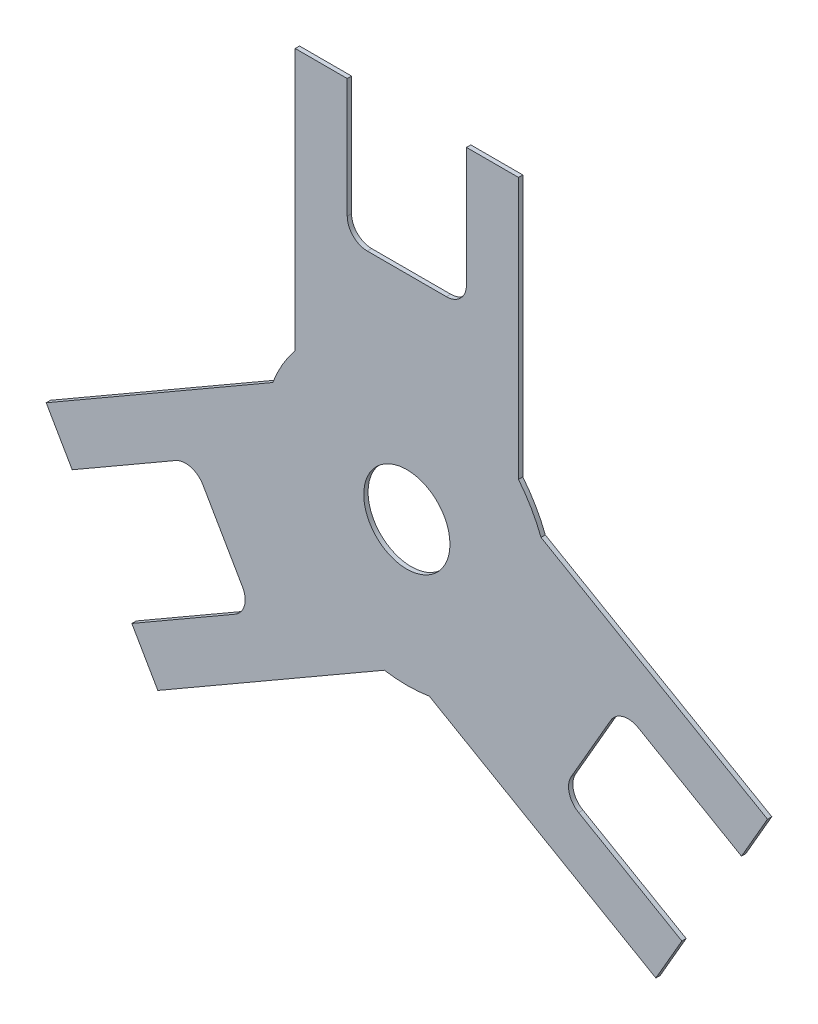
ISO-10303-21;
HEADER;
FILE_DESCRIPTION(('STEP AP214'),'2;1');
FILE_NAME('part.step','',(''),(''),'','','');
FILE_SCHEMA(('AUTOMOTIVE_DESIGN { 1 0 10303 214 1 1 1 1 }'));
ENDSEC;
DATA;
#1=APPLICATION_CONTEXT('core data for automotive mechanical design processes');
#2=APPLICATION_PROTOCOL_DEFINITION('international standard','automotive_design',2000,#1);
#3=PRODUCT_CONTEXT('',#1,'mechanical');
#4=PRODUCT('Part','Part','',(#3));
#5=PRODUCT_RELATED_PRODUCT_CATEGORY('part','',(#4));
#6=PRODUCT_DEFINITION_FORMATION('','',#4);
#7=PRODUCT_DEFINITION_CONTEXT('part definition',#1,'design');
#8=PRODUCT_DEFINITION('design','',#6,#7);
#9=PRODUCT_DEFINITION_SHAPE('','',#8);
#10=(LENGTH_UNIT() NAMED_UNIT(*) SI_UNIT(.MILLI.,.METRE.));
#11=(NAMED_UNIT(*) PLANE_ANGLE_UNIT() SI_UNIT($,.RADIAN.));
#12=(NAMED_UNIT(*) SI_UNIT($,.STERADIAN.) SOLID_ANGLE_UNIT());
#13=UNCERTAINTY_MEASURE_WITH_UNIT(LENGTH_MEASURE(1.E-05),#10,'distance_accuracy_value','');
#14=(GEOMETRIC_REPRESENTATION_CONTEXT(3) GLOBAL_UNCERTAINTY_ASSIGNED_CONTEXT((#13)) GLOBAL_UNIT_ASSIGNED_CONTEXT((#10,
#11,#12)) REPRESENTATION_CONTEXT('',''));
#15=CARTESIAN_POINT('',(0.,0.,0.));
#16=DIRECTION('',(0.,0.,1.));
#17=DIRECTION('',(1.,0.,0.));
#18=AXIS2_PLACEMENT_3D('',#15,#16,#17);
#19=CARTESIAN_POINT('',(-125.51311196359,-27.6049130629751,0.));
#20=DIRECTION('',(-0.500000000000019,0.866025403784428,0.));
#21=DIRECTION('',(0.,0.,1.));
#22=AXIS2_PLACEMENT_3D('',#19,#20,#21);
#23=PLANE('',#22);
#24=DIRECTION('',(-0.866025403784428,-0.500000000000019,0.));
#25=VECTOR('',#24,1.);
#26=CARTESIAN_POINT('',(-46.683175379141,17.90757204426,0.));
#27=LINE('',#26,#25);
#28=CARTESIAN_POINT('',(-46.683175379141,17.90757204426,0.));
#29=VERTEX_POINT('',#28);
#30=CARTESIAN_POINT('',(-125.51311196359,-27.6049130629751,0.));
#31=VERTEX_POINT('',#30);
#32=EDGE_CURVE('E216',#29,#31,#27,.T.);
#33=ORIENTED_EDGE('',*,*,#32,.T.);
#34=DIRECTION('',(0.,0.,1.));
#35=VECTOR('',#34,1.);
#36=CARTESIAN_POINT('',(-125.51311196359,-27.604913062975,0.));
#37=LINE('',#36,#35);
#38=CARTESIAN_POINT('',(-125.51311196359,-27.604913062975,1.5));
#39=VERTEX_POINT('',#38);
#40=EDGE_CURVE('E230',#39,#31,#37,.F.);
#41=ORIENTED_EDGE('',*,*,#40,.F.);
#42=DIRECTION('',(0.866025403784428,0.500000000000019,0.));
#43=VECTOR('',#42,1.);
#44=CARTESIAN_POINT('',(-125.51311196359,-27.6049130629751,1.5));
#45=LINE('',#44,#43);
#46=CARTESIAN_POINT('',(-46.683175379141,17.90757204426,1.5));
#47=VERTEX_POINT('',#46);
#48=EDGE_CURVE('E236',#47,#39,#45,.F.);
#49=ORIENTED_EDGE('',*,*,#48,.F.);
#50=DIRECTION('',(0.,0.,-1.));
#51=VECTOR('',#50,1.);
#52=CARTESIAN_POINT('',(-46.683175379141,17.90757204426,1.5));
#53=LINE('',#52,#51);
#54=EDGE_CURVE('E224',#47,#29,#53,.T.);
#55=ORIENTED_EDGE('',*,*,#54,.T.);
#56=EDGE_LOOP('',(#33,#41,#49,#55));
#57=FACE_BOUND('',#56,.T.);
#58=ADVANCED_FACE('F17',(#57),#23,.T.);
#59=CARTESIAN_POINT('',(-116.46311196359,-43.279972871473,0.));
#60=DIRECTION('',(-0.866025403784434,-0.500000000000008,0.));
#61=DIRECTION('',(0.,0.,1.));
#62=AXIS2_PLACEMENT_3D('',#59,#60,#61);
#63=PLANE('',#62);
#64=DIRECTION('',(0.500000000000008,-0.866025403784434,0.));
#65=VECTOR('',#64,1.);
#66=CARTESIAN_POINT('',(-125.51311196359,-27.604913062975,0.));
#67=LINE('',#66,#65);
#68=CARTESIAN_POINT('',(-116.46311196359,-43.279972871473,0.));
#69=VERTEX_POINT('',#68);
#70=EDGE_CURVE('E212',#31,#69,#67,.T.);
#71=ORIENTED_EDGE('',*,*,#70,.T.);
#72=DIRECTION('',(0.,0.,1.));
#73=VECTOR('',#72,1.);
#74=CARTESIAN_POINT('',(-116.46311196359,-43.279972871473,0.));
#75=LINE('',#74,#73);
#76=CARTESIAN_POINT('',(-116.46311196359,-43.279972871473,1.5));
#77=VERTEX_POINT('',#76);
#78=EDGE_CURVE('E223',#77,#69,#75,.F.);
#79=ORIENTED_EDGE('',*,*,#78,.F.);
#80=DIRECTION('',(-0.500000000000008,0.866025403784434,0.));
#81=VECTOR('',#80,1.);
#82=CARTESIAN_POINT('',(-116.46311196359,-43.279972871473,1.5));
#83=LINE('',#82,#81);
#84=EDGE_CURVE('E235',#39,#77,#83,.F.);
#85=ORIENTED_EDGE('',*,*,#84,.F.);
#86=ORIENTED_EDGE('',*,*,#40,.T.);
#87=EDGE_LOOP('',(#71,#79,#85,#86));
#88=FACE_BOUND('',#87,.T.);
#89=ADVANCED_FACE('F234',(#88),#63,.T.);
#90=CARTESIAN_POINT('',(-80.52305770654,-22.529972871473,0.));
#91=DIRECTION('',(0.500000000000044,-0.866025403784414,0.));
#92=DIRECTION('',(0.,0.,1.));
#93=AXIS2_PLACEMENT_3D('',#90,#91,#92);
#94=PLANE('',#93);
#95=DIRECTION('',(0.866025403784414,0.500000000000044,0.));
#96=VECTOR('',#95,1.);
#97=CARTESIAN_POINT('',(-116.46311196359,-43.279972871473,0.));
#98=LINE('',#97,#96);
#99=CARTESIAN_POINT('',(-80.52305770654,-22.529972871473,0.));
#100=VERTEX_POINT('',#99);
#101=EDGE_CURVE('E218',#69,#100,#98,.T.);
#102=ORIENTED_EDGE('',*,*,#101,.T.);
#103=DIRECTION('',(0.,0.,1.));
#104=VECTOR('',#103,1.);
#105=CARTESIAN_POINT('',(-80.52305770654,-22.529972871473,0.));
#106=LINE('',#105,#104);
#107=CARTESIAN_POINT('',(-80.52305770654,-22.529972871473,1.5));
#108=VERTEX_POINT('',#107);
#109=EDGE_CURVE('E258',#108,#100,#106,.F.);
#110=ORIENTED_EDGE('',*,*,#109,.F.);
#111=DIRECTION('',(-0.866025403784414,-0.500000000000044,0.));
#112=VECTOR('',#111,1.);
#113=CARTESIAN_POINT('',(-80.52305770654,-22.529972871473,1.5));
#114=LINE('',#113,#112);
#115=EDGE_CURVE('E263',#77,#108,#114,.F.);
#116=ORIENTED_EDGE('',*,*,#115,.F.);
#117=ORIENTED_EDGE('',*,*,#78,.T.);
#118=EDGE_LOOP('',(#102,#110,#116,#117));
#119=FACE_BOUND('',#118,.T.);
#120=ADVANCED_FACE('F657',(#119),#94,.T.);
#121=CARTESIAN_POINT('',(-77.0230577065392,-28.5921506979635,1.5));
#122=DIRECTION('',(0.,0.,-1.));
#123=DIRECTION('',(-0.500000000000126,0.866025403784366,0.));
#124=AXIS2_PLACEMENT_3D('',#121,#122,#123);
#125=CYLINDRICAL_SURFACE('',#124,6.99999999999983);
#126=CARTESIAN_POINT('',(-77.0230577065392,-28.5921506979635,0.));
#127=DIRECTION('',(0.,0.,-1.));
#128=DIRECTION('',(-0.500000000000126,0.866025403784366,0.));
#129=AXIS2_PLACEMENT_3D('',#126,#127,#128);
#130=CIRCLE('',#129,6.99999999999983);
#131=CARTESIAN_POINT('',(-70.960879880048,-25.092150697964,0.));
#132=VERTEX_POINT('',#131);
#133=EDGE_CURVE('E267',#132,#100,#130,.F.);
#134=ORIENTED_EDGE('',*,*,#133,.F.);
#135=DIRECTION('',(0.,0.,1.));
#136=VECTOR('',#135,1.);
#137=CARTESIAN_POINT('',(-70.960879880048,-25.092150697964,0.));
#138=LINE('',#137,#136);
#139=CARTESIAN_POINT('',(-70.960879880048,-25.092150697964,1.5));
#140=VERTEX_POINT('',#139);
#141=EDGE_CURVE('E271',#140,#132,#138,.F.);
#142=ORIENTED_EDGE('',*,*,#141,.F.);
#143=CARTESIAN_POINT('',(-77.0230577065392,-28.5921506979635,1.5));
#144=DIRECTION('',(0.,0.,1.));
#145=DIRECTION('',(0.866025403784477,0.499999999999933,0.));
#146=AXIS2_PLACEMENT_3D('',#143,#144,#145);
#147=CIRCLE('',#146,6.99999999999983);
#148=EDGE_CURVE('E276',#140,#108,#147,.T.);
#149=ORIENTED_EDGE('',*,*,#148,.T.);
#150=ORIENTED_EDGE('',*,*,#109,.T.);
#151=EDGE_LOOP('',(#134,#142,#149,#150));
#152=FACE_BOUND('',#151,.T.);
#153=ADVANCED_FACE('F662',(#152),#125,.F.);
#154=CARTESIAN_POINT('',(-57.210879880048,-48.907849302036,0.));
#155=DIRECTION('',(-0.866025403784438,-0.5,0.));
#156=DIRECTION('',(0.,0.,1.));
#157=AXIS2_PLACEMENT_3D('',#154,#155,#156);
#158=PLANE('',#157);
#159=DIRECTION('',(0.5,-0.866025403784439,0.));
#160=VECTOR('',#159,1.);
#161=CARTESIAN_POINT('',(-70.960879880048,-25.092150697964,0.));
#162=LINE('',#161,#160);
#163=CARTESIAN_POINT('',(-57.210879880048,-48.907849302036,0.));
#164=VERTEX_POINT('',#163);
#165=EDGE_CURVE('E281',#132,#164,#162,.T.);
#166=ORIENTED_EDGE('',*,*,#165,.T.);
#167=DIRECTION('',(0.,0.,1.));
#168=VECTOR('',#167,1.);
#169=CARTESIAN_POINT('',(-57.210879880048,-48.907849302036,0.));
#170=LINE('',#169,#168);
#171=CARTESIAN_POINT('',(-57.210879880048,-48.907849302036,1.5));
#172=VERTEX_POINT('',#171);
#173=EDGE_CURVE('E286',#172,#164,#170,.F.);
#174=ORIENTED_EDGE('',*,*,#173,.F.);
#175=DIRECTION('',(-0.5,0.866025403784439,0.));
#176=VECTOR('',#175,1.);
#177=CARTESIAN_POINT('',(-57.210879880048,-48.907849302036,1.5));
#178=LINE('',#177,#176);
#179=EDGE_CURVE('E291',#140,#172,#178,.F.);
#180=ORIENTED_EDGE('',*,*,#179,.F.);
#181=ORIENTED_EDGE('',*,*,#141,.T.);
#182=EDGE_LOOP('',(#166,#174,#180,#181));
#183=FACE_BOUND('',#182,.T.);
#184=ADVANCED_FACE('F666',(#183),#158,.T.);
#185=CARTESIAN_POINT('',(-63.2730577065391,-52.4078493020356,1.5));
#186=DIRECTION('',(0.,0.,-1.));
#187=DIRECTION('',(0.866025403784464,0.499999999999956,0.));
#188=AXIS2_PLACEMENT_3D('',#185,#186,#187);
#189=CYLINDRICAL_SURFACE('',#188,6.99999999999984);
#190=CARTESIAN_POINT('',(-63.2730577065391,-52.4078493020356,0.));
#191=DIRECTION('',(0.,0.,-1.));
#192=DIRECTION('',(0.866025403784464,0.499999999999956,0.));
#193=AXIS2_PLACEMENT_3D('',#190,#191,#192);
#194=CIRCLE('',#193,6.99999999999984);
#195=CARTESIAN_POINT('',(-59.77305770654,-58.470027128527,0.));
#196=VERTEX_POINT('',#195);
#197=EDGE_CURVE('E295',#196,#164,#194,.F.);
#198=ORIENTED_EDGE('',*,*,#197,.F.);
#199=DIRECTION('',(0.,0.,1.));
#200=VECTOR('',#199,1.);
#201=CARTESIAN_POINT('',(-59.77305770654,-58.470027128527,0.));
#202=LINE('',#201,#200);
#203=CARTESIAN_POINT('',(-59.77305770654,-58.470027128527,1.5));
#204=VERTEX_POINT('',#203);
#205=EDGE_CURVE('E299',#204,#196,#202,.F.);
#206=ORIENTED_EDGE('',*,*,#205,.F.);
#207=CARTESIAN_POINT('',(-63.2730577065391,-52.4078493020356,1.5));
#208=DIRECTION('',(0.,0.,1.));
#209=DIRECTION('',(0.499999999999884,-0.866025403784505,0.));
#210=AXIS2_PLACEMENT_3D('',#207,#208,#209);
#211=CIRCLE('',#210,6.99999999999984);
#212=EDGE_CURVE('E304',#204,#172,#211,.T.);
#213=ORIENTED_EDGE('',*,*,#212,.T.);
#214=ORIENTED_EDGE('',*,*,#173,.T.);
#215=EDGE_LOOP('',(#198,#206,#213,#214));
#216=FACE_BOUND('',#215,.T.);
#217=ADVANCED_FACE('F670',(#216),#189,.F.);
#218=CARTESIAN_POINT('',(-95.7131119635941,-79.2200271285269,0.));
#219=DIRECTION('',(-0.5,0.866025403784438,0.));
#220=DIRECTION('',(0.,0.,1.));
#221=AXIS2_PLACEMENT_3D('',#218,#219,#220);
#222=PLANE('',#221);
#223=DIRECTION('',(-0.866025403784439,-0.5,0.));
#224=VECTOR('',#223,1.);
#225=CARTESIAN_POINT('',(-59.77305770654,-58.470027128527,0.));
#226=LINE('',#225,#224);
#227=CARTESIAN_POINT('',(-95.7131119635941,-79.2200271285269,0.));
#228=VERTEX_POINT('',#227);
#229=EDGE_CURVE('E309',#196,#228,#226,.T.);
#230=ORIENTED_EDGE('',*,*,#229,.T.);
#231=DIRECTION('',(0.,0.,1.));
#232=VECTOR('',#231,1.);
#233=CARTESIAN_POINT('',(-95.713111963594,-79.2200271285269,0.));
#234=LINE('',#233,#232);
#235=CARTESIAN_POINT('',(-95.713111963594,-79.2200271285269,1.5));
#236=VERTEX_POINT('',#235);
#237=EDGE_CURVE('E314',#236,#228,#234,.F.);
#238=ORIENTED_EDGE('',*,*,#237,.F.);
#239=DIRECTION('',(0.866025403784439,0.5,0.));
#240=VECTOR('',#239,1.);
#241=CARTESIAN_POINT('',(-95.7131119635941,-79.2200271285269,1.5));
#242=LINE('',#241,#240);
#243=EDGE_CURVE('E319',#204,#236,#242,.F.);
#244=ORIENTED_EDGE('',*,*,#243,.F.);
#245=ORIENTED_EDGE('',*,*,#205,.T.);
#246=EDGE_LOOP('',(#230,#238,#244,#245));
#247=FACE_BOUND('',#246,.T.);
#248=ADVANCED_FACE('F674',(#247),#222,.T.);
#249=CARTESIAN_POINT('',(-86.663111963594,-94.895086937025,0.));
#250=DIRECTION('',(-0.866025403784435,-0.500000000000007,0.));
#251=DIRECTION('',(0.,0.,1.));
#252=AXIS2_PLACEMENT_3D('',#249,#250,#251);
#253=PLANE('',#252);
#254=DIRECTION('',(0.500000000000007,-0.866025403784435,0.));
#255=VECTOR('',#254,1.);
#256=CARTESIAN_POINT('',(-95.713111963594,-79.2200271285269,0.));
#257=LINE('',#256,#255);
#258=CARTESIAN_POINT('',(-86.663111963594,-94.895086937025,0.));
#259=VERTEX_POINT('',#258);
#260=EDGE_CURVE('E323',#228,#259,#257,.T.);
#261=ORIENTED_EDGE('',*,*,#260,.T.);
#262=DIRECTION('',(0.,0.,1.));
#263=VECTOR('',#262,1.);
#264=CARTESIAN_POINT('',(-86.663111963594,-94.895086937025,0.));
#265=LINE('',#264,#263);
#266=CARTESIAN_POINT('',(-86.663111963594,-94.895086937025,1.5));
#267=VERTEX_POINT('',#266);
#268=EDGE_CURVE('E328',#267,#259,#265,.F.);
#269=ORIENTED_EDGE('',*,*,#268,.F.);
#270=DIRECTION('',(-0.500000000000007,0.866025403784435,0.));
#271=VECTOR('',#270,1.);
#272=CARTESIAN_POINT('',(-86.663111963594,-94.895086937025,1.5));
#273=LINE('',#272,#271);
#274=EDGE_CURVE('E333',#236,#267,#273,.F.);
#275=ORIENTED_EDGE('',*,*,#274,.F.);
#276=ORIENTED_EDGE('',*,*,#237,.T.);
#277=EDGE_LOOP('',(#261,#269,#275,#276));
#278=FACE_BOUND('',#277,.T.);
#279=ADVANCED_FACE('F678',(#278),#253,.T.);
#280=CARTESIAN_POINT('',(-7.83317537914092,-49.3826018297899,0.));
#281=DIRECTION('',(0.5,-0.866025403784439,0.));
#282=DIRECTION('',(0.,0.,1.));
#283=AXIS2_PLACEMENT_3D('',#280,#281,#282);
#284=PLANE('',#283);
#285=DIRECTION('',(0.866025403784439,0.5,0.));
#286=VECTOR('',#285,1.);
#287=CARTESIAN_POINT('',(-86.663111963594,-94.895086937025,0.));
#288=LINE('',#287,#286);
#289=CARTESIAN_POINT('',(-7.83317537914093,-49.3826018297899,0.));
#290=VERTEX_POINT('',#289);
#291=EDGE_CURVE('E337',#259,#290,#288,.T.);
#292=ORIENTED_EDGE('',*,*,#291,.T.);
#293=DIRECTION('',(0.,0.,1.));
#294=VECTOR('',#293,1.);
#295=CARTESIAN_POINT('',(-7.83317537914094,-49.3826018297899,0.));
#296=LINE('',#295,#294);
#297=CARTESIAN_POINT('',(-7.83317537914094,-49.3826018297899,1.5));
#298=VERTEX_POINT('',#297);
#299=EDGE_CURVE('E342',#298,#290,#296,.F.);
#300=ORIENTED_EDGE('',*,*,#299,.F.);
#301=DIRECTION('',(-0.866025403784439,-0.5,0.));
#302=VECTOR('',#301,1.);
#303=CARTESIAN_POINT('',(-7.83317537914092,-49.3826018297899,1.5));
#304=LINE('',#303,#302);
#305=EDGE_CURVE('E347',#267,#298,#304,.F.);
#306=ORIENTED_EDGE('',*,*,#305,.F.);
#307=ORIENTED_EDGE('',*,*,#268,.T.);
#308=EDGE_LOOP('',(#292,#300,#306,#307));
#309=FACE_BOUND('',#308,.T.);
#310=ADVANCED_FACE('F682',(#309),#284,.T.);
#311=CARTESIAN_POINT('',(0.,-3.44863027024189E-11,1.5));
#312=DIRECTION('',(0.,0.,-1.));
#313=DIRECTION('',(0.156663507582926,-0.987652036595791,0.));
#314=AXIS2_PLACEMENT_3D('',#311,#312,#313);
#315=CYLINDRICAL_SURFACE('',#314,49.9999999999655);
#316=CARTESIAN_POINT('',(0.,-3.44863027024189E-11,0.));
#317=DIRECTION('',(0.,0.,1.));
#318=DIRECTION('',(-0.156663507582927,-0.987652036595791,0.));
#319=AXIS2_PLACEMENT_3D('',#316,#317,#318);
#320=CIRCLE('',#319,49.9999999999655);
#321=CARTESIAN_POINT('',(7.83317537914089,-49.38260182979,0.));
#322=VERTEX_POINT('',#321);
#323=EDGE_CURVE('E351',#290,#322,#320,.T.);
#324=ORIENTED_EDGE('',*,*,#323,.T.);
#325=DIRECTION('',(0.,0.,1.));
#326=VECTOR('',#325,1.);
#327=CARTESIAN_POINT('',(7.83317537914089,-49.38260182979,0.));
#328=LINE('',#327,#326);
#329=CARTESIAN_POINT('',(7.83317537914089,-49.38260182979,1.5));
#330=VERTEX_POINT('',#329);
#331=EDGE_CURVE('E356',#330,#322,#328,.F.);
#332=ORIENTED_EDGE('',*,*,#331,.F.);
#333=CARTESIAN_POINT('',(0.,-3.44863027024189E-11,1.5));
#334=DIRECTION('',(0.,0.,-1.));
#335=DIRECTION('',(0.156663507582926,-0.987652036595791,0.));
#336=AXIS2_PLACEMENT_3D('',#333,#334,#335);
#337=CIRCLE('',#336,49.9999999999655);
#338=EDGE_CURVE('E361',#298,#330,#337,.F.);
#339=ORIENTED_EDGE('',*,*,#338,.F.);
#340=ORIENTED_EDGE('',*,*,#299,.T.);
#341=EDGE_LOOP('',(#324,#332,#339,#340));
#342=FACE_BOUND('',#341,.T.);
#343=ADVANCED_FACE('F686',(#342),#315,.T.);
#344=CARTESIAN_POINT('',(86.663111963594,-94.8950869370251,0.));
#345=DIRECTION('',(-0.5,-0.866025403784439,0.));
#346=DIRECTION('',(0.,0.,1.));
#347=AXIS2_PLACEMENT_3D('',#344,#345,#346);
#348=PLANE('',#347);
#349=DIRECTION('',(0.866025403784439,-0.5,0.));
#350=VECTOR('',#349,1.);
#351=CARTESIAN_POINT('',(7.83317537914088,-49.38260182979,0.));
#352=LINE('',#351,#350);
#353=CARTESIAN_POINT('',(86.663111963594,-94.8950869370251,0.));
#354=VERTEX_POINT('',#353);
#355=EDGE_CURVE('E365',#322,#354,#352,.T.);
#356=ORIENTED_EDGE('',*,*,#355,.T.);
#357=DIRECTION('',(0.,0.,1.));
#358=VECTOR('',#357,1.);
#359=CARTESIAN_POINT('',(86.6631119635939,-94.8950869370251,0.));
#360=LINE('',#359,#358);
#361=CARTESIAN_POINT('',(86.6631119635939,-94.8950869370251,1.5));
#362=VERTEX_POINT('',#361);
#363=EDGE_CURVE('E370',#362,#354,#360,.F.);
#364=ORIENTED_EDGE('',*,*,#363,.F.);
#365=DIRECTION('',(-0.866025403784439,0.5,0.));
#366=VECTOR('',#365,1.);
#367=CARTESIAN_POINT('',(86.663111963594,-94.8950869370251,1.5));
#368=LINE('',#367,#366);
#369=EDGE_CURVE('E375',#330,#362,#368,.F.);
#370=ORIENTED_EDGE('',*,*,#369,.F.);
#371=ORIENTED_EDGE('',*,*,#331,.T.);
#372=EDGE_LOOP('',(#356,#364,#370,#371));
#373=FACE_BOUND('',#372,.T.);
#374=ADVANCED_FACE('F690',(#373),#348,.T.);
#375=CARTESIAN_POINT('',(95.713111963594,-79.220027128527,0.));
#376=DIRECTION('',(0.866025403784435,-0.500000000000007,0.));
#377=DIRECTION('',(0.,0.,1.));
#378=AXIS2_PLACEMENT_3D('',#375,#376,#377);
#379=PLANE('',#378);
#380=DIRECTION('',(0.500000000000007,0.866025403784435,0.));
#381=VECTOR('',#380,1.);
#382=CARTESIAN_POINT('',(86.663111963594,-94.8950869370251,0.));
#383=LINE('',#382,#381);
#384=CARTESIAN_POINT('',(95.713111963594,-79.220027128527,0.));
#385=VERTEX_POINT('',#384);
#386=EDGE_CURVE('E379',#354,#385,#383,.T.);
#387=ORIENTED_EDGE('',*,*,#386,.T.);
#388=DIRECTION('',(0.,0.,1.));
#389=VECTOR('',#388,1.);
#390=CARTESIAN_POINT('',(95.713111963594,-79.220027128527,0.));
#391=LINE('',#390,#389);
#392=CARTESIAN_POINT('',(95.713111963594,-79.220027128527,1.5));
#393=VERTEX_POINT('',#392);
#394=EDGE_CURVE('E384',#393,#385,#391,.F.);
#395=ORIENTED_EDGE('',*,*,#394,.F.);
#396=DIRECTION('',(-0.500000000000007,-0.866025403784435,0.));
#397=VECTOR('',#396,1.);
#398=CARTESIAN_POINT('',(95.713111963594,-79.220027128527,1.5));
#399=LINE('',#398,#397);
#400=EDGE_CURVE('E389',#362,#393,#399,.F.);
#401=ORIENTED_EDGE('',*,*,#400,.F.);
#402=ORIENTED_EDGE('',*,*,#363,.T.);
#403=EDGE_LOOP('',(#387,#395,#401,#402));
#404=FACE_BOUND('',#403,.T.);
#405=ADVANCED_FACE('F694',(#404),#379,.T.);
#406=CARTESIAN_POINT('',(59.7730577065399,-58.4700271285271,0.));
#407=DIRECTION('',(0.5,0.866025403784438,0.));
#408=DIRECTION('',(0.,0.,1.));
#409=AXIS2_PLACEMENT_3D('',#406,#407,#408);
#410=PLANE('',#409);
#411=DIRECTION('',(-0.866025403784439,0.5,0.));
#412=VECTOR('',#411,1.);
#413=CARTESIAN_POINT('',(95.713111963594,-79.220027128527,0.));
#414=LINE('',#413,#412);
#415=CARTESIAN_POINT('',(59.7730577065399,-58.4700271285271,0.));
#416=VERTEX_POINT('',#415);
#417=EDGE_CURVE('E393',#385,#416,#414,.T.);
#418=ORIENTED_EDGE('',*,*,#417,.T.);
#419=DIRECTION('',(0.,0.,1.));
#420=VECTOR('',#419,1.);
#421=CARTESIAN_POINT('',(59.77305770654,-58.4700271285271,0.));
#422=LINE('',#421,#420);
#423=CARTESIAN_POINT('',(59.77305770654,-58.4700271285271,1.5));
#424=VERTEX_POINT('',#423);
#425=EDGE_CURVE('E398',#424,#416,#422,.F.);
#426=ORIENTED_EDGE('',*,*,#425,.F.);
#427=DIRECTION('',(0.866025403784439,-0.5,0.));
#428=VECTOR('',#427,1.);
#429=CARTESIAN_POINT('',(59.7730577065399,-58.4700271285271,1.5));
#430=LINE('',#429,#428);
#431=EDGE_CURVE('E403',#393,#424,#430,.F.);
#432=ORIENTED_EDGE('',*,*,#431,.F.);
#433=ORIENTED_EDGE('',*,*,#394,.T.);
#434=EDGE_LOOP('',(#418,#426,#432,#433));
#435=FACE_BOUND('',#434,.T.);
#436=ADVANCED_FACE('F698',(#435),#410,.T.);
#437=CARTESIAN_POINT('',(63.2730577065391,-52.4078493020356,1.5));
#438=DIRECTION('',(0.,0.,-1.));
#439=DIRECTION('',(-0.499999999999884,-0.866025403784506,0.));
#440=AXIS2_PLACEMENT_3D('',#437,#438,#439);
#441=CYLINDRICAL_SURFACE('',#440,6.99999999999983);
#442=CARTESIAN_POINT('',(63.2730577065391,-52.4078493020356,0.));
#443=DIRECTION('',(0.,0.,-1.));
#444=DIRECTION('',(-0.499999999999884,-0.866025403784506,0.));
#445=AXIS2_PLACEMENT_3D('',#442,#443,#444);
#446=CIRCLE('',#445,6.99999999999983);
#447=CARTESIAN_POINT('',(57.210879880048,-48.907849302036,0.));
#448=VERTEX_POINT('',#447);
#449=EDGE_CURVE('E407',#448,#416,#446,.F.);
#450=ORIENTED_EDGE('',*,*,#449,.F.);
#451=DIRECTION('',(0.,0.,1.));
#452=VECTOR('',#451,1.);
#453=CARTESIAN_POINT('',(57.210879880048,-48.907849302036,0.));
#454=LINE('',#453,#452);
#455=CARTESIAN_POINT('',(57.210879880048,-48.907849302036,1.5));
#456=VERTEX_POINT('',#455);
#457=EDGE_CURVE('E411',#456,#448,#454,.F.);
#458=ORIENTED_EDGE('',*,*,#457,.F.);
#459=CARTESIAN_POINT('',(63.2730577065391,-52.4078493020356,1.5));
#460=DIRECTION('',(0.,0.,1.));
#461=DIRECTION('',(-0.866025403784464,0.499999999999956,0.));
#462=AXIS2_PLACEMENT_3D('',#459,#460,#461);
#463=CIRCLE('',#462,6.99999999999983);
#464=EDGE_CURVE('E416',#456,#424,#463,.T.);
#465=ORIENTED_EDGE('',*,*,#464,.T.);
#466=ORIENTED_EDGE('',*,*,#425,.T.);
#467=EDGE_LOOP('',(#450,#458,#465,#466));
#468=FACE_BOUND('',#467,.T.);
#469=ADVANCED_FACE('F702',(#468),#441,.F.);
#470=CARTESIAN_POINT('',(70.960879880048,-25.092150697964,0.));
#471=DIRECTION('',(0.866025403784438,-0.5,0.));
#472=DIRECTION('',(0.,0.,1.));
#473=AXIS2_PLACEMENT_3D('',#470,#471,#472);
#474=PLANE('',#473);
#475=DIRECTION('',(0.5,0.866025403784438,0.));
#476=VECTOR('',#475,1.);
#477=CARTESIAN_POINT('',(57.210879880048,-48.907849302036,0.));
#478=LINE('',#477,#476);
#479=CARTESIAN_POINT('',(70.960879880048,-25.092150697964,0.));
#480=VERTEX_POINT('',#479);
#481=EDGE_CURVE('E421',#448,#480,#478,.T.);
#482=ORIENTED_EDGE('',*,*,#481,.T.);
#483=DIRECTION('',(0.,0.,1.));
#484=VECTOR('',#483,1.);
#485=CARTESIAN_POINT('',(70.960879880048,-25.092150697964,0.));
#486=LINE('',#485,#484);
#487=CARTESIAN_POINT('',(70.960879880048,-25.092150697964,1.5));
#488=VERTEX_POINT('',#487);
#489=EDGE_CURVE('E426',#488,#480,#486,.F.);
#490=ORIENTED_EDGE('',*,*,#489,.F.);
#491=DIRECTION('',(-0.5,-0.866025403784438,0.));
#492=VECTOR('',#491,1.);
#493=CARTESIAN_POINT('',(70.960879880048,-25.092150697964,1.5));
#494=LINE('',#493,#492);
#495=EDGE_CURVE('E431',#456,#488,#494,.F.);
#496=ORIENTED_EDGE('',*,*,#495,.F.);
#497=ORIENTED_EDGE('',*,*,#457,.T.);
#498=EDGE_LOOP('',(#482,#490,#496,#497));
#499=FACE_BOUND('',#498,.T.);
#500=ADVANCED_FACE('F706',(#499),#474,.T.);
#501=CARTESIAN_POINT('',(77.0230577065392,-28.5921506979635,1.5));
#502=DIRECTION('',(0.,0.,-1.));
#503=DIRECTION('',(-0.866025403784477,0.499999999999933,0.));
#504=AXIS2_PLACEMENT_3D('',#501,#502,#503);
#505=CYLINDRICAL_SURFACE('',#504,6.99999999999985);
#506=CARTESIAN_POINT('',(77.0230577065392,-28.5921506979635,0.));
#507=DIRECTION('',(0.,0.,-1.));
#508=DIRECTION('',(-0.866025403784477,0.499999999999934,0.));
#509=AXIS2_PLACEMENT_3D('',#506,#507,#508);
#510=CIRCLE('',#509,6.99999999999985);
#511=CARTESIAN_POINT('',(80.52305770654,-22.529972871473,0.));
#512=VERTEX_POINT('',#511);
#513=EDGE_CURVE('E435',#512,#480,#510,.F.);
#514=ORIENTED_EDGE('',*,*,#513,.F.);
#515=DIRECTION('',(0.,0.,1.));
#516=VECTOR('',#515,1.);
#517=CARTESIAN_POINT('',(80.52305770654,-22.529972871473,0.));
#518=LINE('',#517,#516);
#519=CARTESIAN_POINT('',(80.52305770654,-22.529972871473,1.5));
#520=VERTEX_POINT('',#519);
#521=EDGE_CURVE('E439',#520,#512,#518,.F.);
#522=ORIENTED_EDGE('',*,*,#521,.F.);
#523=CARTESIAN_POINT('',(77.0230577065392,-28.5921506979635,1.5));
#524=DIRECTION('',(0.,0.,1.));
#525=DIRECTION('',(0.500000000000126,0.866025403784366,0.));
#526=AXIS2_PLACEMENT_3D('',#523,#524,#525);
#527=CIRCLE('',#526,6.99999999999985);
#528=EDGE_CURVE('E444',#520,#488,#527,.T.);
#529=ORIENTED_EDGE('',*,*,#528,.T.);
#530=ORIENTED_EDGE('',*,*,#489,.T.);
#531=EDGE_LOOP('',(#514,#522,#529,#530));
#532=FACE_BOUND('',#531,.T.);
#533=ADVANCED_FACE('F710',(#532),#505,.F.);
#534=CARTESIAN_POINT('',(116.46311196359,-43.279972871473,0.));
#535=DIRECTION('',(-0.500000000000044,-0.866025403784414,0.));
#536=DIRECTION('',(0.,0.,1.));
#537=AXIS2_PLACEMENT_3D('',#534,#535,#536);
#538=PLANE('',#537);
#539=DIRECTION('',(0.866025403784414,-0.500000000000044,0.));
#540=VECTOR('',#539,1.);
#541=CARTESIAN_POINT('',(80.52305770654,-22.529972871473,0.));
#542=LINE('',#541,#540);
#543=CARTESIAN_POINT('',(116.46311196359,-43.279972871473,0.));
#544=VERTEX_POINT('',#543);
#545=EDGE_CURVE('E449',#512,#544,#542,.T.);
#546=ORIENTED_EDGE('',*,*,#545,.T.);
#547=DIRECTION('',(0.,0.,1.));
#548=VECTOR('',#547,1.);
#549=CARTESIAN_POINT('',(116.46311196359,-43.279972871473,0.));
#550=LINE('',#549,#548);
#551=CARTESIAN_POINT('',(116.46311196359,-43.279972871473,1.5));
#552=VERTEX_POINT('',#551);
#553=EDGE_CURVE('E454',#552,#544,#550,.F.);
#554=ORIENTED_EDGE('',*,*,#553,.F.);
#555=DIRECTION('',(-0.866025403784414,0.500000000000044,0.));
#556=VECTOR('',#555,1.);
#557=CARTESIAN_POINT('',(116.46311196359,-43.279972871473,1.5));
#558=LINE('',#557,#556);
#559=EDGE_CURVE('E459',#520,#552,#558,.F.);
#560=ORIENTED_EDGE('',*,*,#559,.F.);
#561=ORIENTED_EDGE('',*,*,#521,.T.);
#562=EDGE_LOOP('',(#546,#554,#560,#561));
#563=FACE_BOUND('',#562,.T.);
#564=ADVANCED_FACE('F714',(#563),#538,.T.);
#565=CARTESIAN_POINT('',(125.51311196359,-27.604913062975,0.));
#566=DIRECTION('',(0.866025403784434,-0.500000000000008,0.));
#567=DIRECTION('',(0.,0.,1.));
#568=AXIS2_PLACEMENT_3D('',#565,#566,#567);
#569=PLANE('',#568);
#570=DIRECTION('',(0.500000000000008,0.866025403784434,0.));
#571=VECTOR('',#570,1.);
#572=CARTESIAN_POINT('',(116.46311196359,-43.279972871473,0.));
#573=LINE('',#572,#571);
#574=CARTESIAN_POINT('',(125.51311196359,-27.604913062975,0.));
#575=VERTEX_POINT('',#574);
#576=EDGE_CURVE('E463',#544,#575,#573,.T.);
#577=ORIENTED_EDGE('',*,*,#576,.T.);
#578=DIRECTION('',(0.,0.,1.));
#579=VECTOR('',#578,1.);
#580=CARTESIAN_POINT('',(125.51311196359,-27.604913062975,0.));
#581=LINE('',#580,#579);
#582=CARTESIAN_POINT('',(125.51311196359,-27.604913062975,1.5));
#583=VERTEX_POINT('',#582);
#584=EDGE_CURVE('E468',#583,#575,#581,.F.);
#585=ORIENTED_EDGE('',*,*,#584,.F.);
#586=DIRECTION('',(-0.500000000000008,-0.866025403784434,0.));
#587=VECTOR('',#586,1.);
#588=CARTESIAN_POINT('',(125.51311196359,-27.604913062975,1.5));
#589=LINE('',#588,#587);
#590=EDGE_CURVE('E473',#552,#583,#589,.F.);
#591=ORIENTED_EDGE('',*,*,#590,.F.);
#592=ORIENTED_EDGE('',*,*,#553,.T.);
#593=EDGE_LOOP('',(#577,#585,#591,#592));
#594=FACE_BOUND('',#593,.T.);
#595=ADVANCED_FACE('F718',(#594),#569,.T.);
#596=CARTESIAN_POINT('',(46.683175379141,17.9075720442601,0.));
#597=DIRECTION('',(0.500000000000019,0.866025403784428,0.));
#598=DIRECTION('',(0.,0.,1.));
#599=AXIS2_PLACEMENT_3D('',#596,#597,#598);
#600=PLANE('',#599);
#601=DIRECTION('',(-0.866025403784428,0.500000000000019,0.));
#602=VECTOR('',#601,1.);
#603=CARTESIAN_POINT('',(125.51311196359,-27.604913062975,0.));
#604=LINE('',#603,#602);
#605=CARTESIAN_POINT('',(46.683175379141,17.9075720442601,0.));
#606=VERTEX_POINT('',#605);
#607=EDGE_CURVE('E477',#575,#606,#604,.T.);
#608=ORIENTED_EDGE('',*,*,#607,.T.);
#609=DIRECTION('',(0.,0.,1.));
#610=VECTOR('',#609,1.);
#611=CARTESIAN_POINT('',(46.683175379141,17.90757204426,0.));
#612=LINE('',#611,#610);
#613=CARTESIAN_POINT('',(46.683175379141,17.90757204426,1.5));
#614=VERTEX_POINT('',#613);
#615=EDGE_CURVE('E482',#614,#606,#612,.F.);
#616=ORIENTED_EDGE('',*,*,#615,.F.);
#617=DIRECTION('',(0.866025403784428,-0.500000000000019,0.));
#618=VECTOR('',#617,1.);
#619=CARTESIAN_POINT('',(46.683175379141,17.9075720442601,1.5));
#620=LINE('',#619,#618);
#621=EDGE_CURVE('E487',#583,#614,#620,.F.);
#622=ORIENTED_EDGE('',*,*,#621,.F.);
#623=ORIENTED_EDGE('',*,*,#584,.T.);
#624=EDGE_LOOP('',(#608,#616,#622,#623));
#625=FACE_BOUND('',#624,.T.);
#626=ADVANCED_FACE('F722',(#625),#600,.T.);
#627=CARTESIAN_POINT('',(4.25354196309513E-12,2.56739074444567E-12,1.5));
#628=DIRECTION('',(0.,0.,-1.));
#629=DIRECTION('',(0.776999999999991,0.62950059571061,0.));
#630=AXIS2_PLACEMENT_3D('',#627,#628,#629);
#631=CYLINDRICAL_SURFACE('',#630,49.9999999999951);
#632=CARTESIAN_POINT('',(4.25354196309513E-12,2.56739074444567E-12,0.));
#633=DIRECTION('',(0.,0.,1.));
#634=DIRECTION('',(0.933663507582826,0.358151440885184,0.));
#635=AXIS2_PLACEMENT_3D('',#632,#633,#634);
#636=CIRCLE('',#635,49.9999999999951);
#637=CARTESIAN_POINT('',(38.85,31.47502978553,0.));
#638=VERTEX_POINT('',#637);
#639=EDGE_CURVE('E491',#606,#638,#636,.T.);
#640=ORIENTED_EDGE('',*,*,#639,.T.);
#641=DIRECTION('',(0.,0.,1.));
#642=VECTOR('',#641,1.);
#643=CARTESIAN_POINT('',(38.85,31.47502978553,0.));
#644=LINE('',#643,#642);
#645=CARTESIAN_POINT('',(38.85,31.47502978553,1.5));
#646=VERTEX_POINT('',#645);
#647=EDGE_CURVE('E496',#646,#638,#644,.F.);
#648=ORIENTED_EDGE('',*,*,#647,.F.);
#649=CARTESIAN_POINT('',(4.25354196309513E-12,2.56739074444567E-12,1.5));
#650=DIRECTION('',(0.,0.,-1.));
#651=DIRECTION('',(0.776999999999991,0.62950059571061,0.));
#652=AXIS2_PLACEMENT_3D('',#649,#650,#651);
#653=CIRCLE('',#652,49.9999999999951);
#654=EDGE_CURVE('E501',#614,#646,#653,.F.);
#655=ORIENTED_EDGE('',*,*,#654,.F.);
#656=ORIENTED_EDGE('',*,*,#615,.T.);
#657=EDGE_LOOP('',(#640,#648,#655,#656));
#658=FACE_BOUND('',#657,.T.);
#659=ADVANCED_FACE('F726',(#658),#631,.T.);
#660=CARTESIAN_POINT('',(38.85,31.47502978553,0.));
#661=DIRECTION('',(1.,0.,0.));
#662=DIRECTION('',(0.,1.,0.));
#663=AXIS2_PLACEMENT_3D('',#660,#661,#662);
#664=PLANE('',#663);
#665=DIRECTION('',(0.,1.,0.));
#666=VECTOR('',#665,1.);
#667=CARTESIAN_POINT('',(38.85,31.47502978553,0.));
#668=LINE('',#667,#666);
#669=CARTESIAN_POINT('',(38.85,122.5,0.));
#670=VERTEX_POINT('',#669);
#671=EDGE_CURVE('E505',#638,#670,#668,.T.);
#672=ORIENTED_EDGE('',*,*,#671,.T.);
#673=DIRECTION('',(0.,0.,1.));
#674=VECTOR('',#673,1.);
#675=CARTESIAN_POINT('',(38.85,122.5,0.));
#676=LINE('',#675,#674);
#677=CARTESIAN_POINT('',(38.85,122.5,1.5));
#678=VERTEX_POINT('',#677);
#679=EDGE_CURVE('E510',#678,#670,#676,.F.);
#680=ORIENTED_EDGE('',*,*,#679,.F.);
#681=DIRECTION('',(0.,-1.,0.));
#682=VECTOR('',#681,1.);
#683=CARTESIAN_POINT('',(38.85,122.5,1.5));
#684=LINE('',#683,#682);
#685=EDGE_CURVE('E515',#646,#678,#684,.F.);
#686=ORIENTED_EDGE('',*,*,#685,.F.);
#687=ORIENTED_EDGE('',*,*,#647,.T.);
#688=EDGE_LOOP('',(#672,#680,#686,#687));
#689=FACE_BOUND('',#688,.T.);
#690=ADVANCED_FACE('F730',(#689),#664,.T.);
#691=CARTESIAN_POINT('',(20.75,122.5,1.5));
#692=DIRECTION('',(0.,1.,0.));
#693=DIRECTION('',(1.,0.,0.));
#694=AXIS2_PLACEMENT_3D('',#691,#692,#693);
#695=PLANE('',#694);
#696=DIRECTION('',(-1.,0.,0.));
#697=VECTOR('',#696,1.);
#698=CARTESIAN_POINT('',(38.85,122.5,0.));
#699=LINE('',#698,#697);
#700=CARTESIAN_POINT('',(20.75,122.5,0.));
#701=VERTEX_POINT('',#700);
#702=EDGE_CURVE('E519',#670,#701,#699,.T.);
#703=ORIENTED_EDGE('',*,*,#702,.T.);
#704=DIRECTION('',(0.,0.,1.));
#705=VECTOR('',#704,1.);
#706=CARTESIAN_POINT('',(20.75,122.5,0.));
#707=LINE('',#706,#705);
#708=CARTESIAN_POINT('',(20.75,122.5,1.5));
#709=VERTEX_POINT('',#708);
#710=EDGE_CURVE('E524',#709,#701,#707,.F.);
#711=ORIENTED_EDGE('',*,*,#710,.F.);
#712=DIRECTION('',(1.,0.,0.));
#713=VECTOR('',#712,1.);
#714=CARTESIAN_POINT('',(20.75,122.5,1.5));
#715=LINE('',#714,#713);
#716=EDGE_CURVE('E529',#678,#709,#715,.F.);
#717=ORIENTED_EDGE('',*,*,#716,.F.);
#718=ORIENTED_EDGE('',*,*,#679,.T.);
#719=EDGE_LOOP('',(#703,#711,#717,#718));
#720=FACE_BOUND('',#719,.T.);
#721=ADVANCED_FACE('F734',(#720),#695,.T.);
#722=CARTESIAN_POINT('',(20.75,81.,1.5));
#723=DIRECTION('',(-1.,0.,0.));
#724=DIRECTION('',(0.,1.,0.));
#725=AXIS2_PLACEMENT_3D('',#722,#723,#724);
#726=PLANE('',#725);
#727=DIRECTION('',(0.,-1.,0.));
#728=VECTOR('',#727,1.);
#729=CARTESIAN_POINT('',(20.75,122.5,0.));
#730=LINE('',#729,#728);
#731=CARTESIAN_POINT('',(20.75,81.,0.));
#732=VERTEX_POINT('',#731);
#733=EDGE_CURVE('E533',#701,#732,#730,.T.);
#734=ORIENTED_EDGE('',*,*,#733,.T.);
#735=DIRECTION('',(0.,0.,1.));
#736=VECTOR('',#735,1.);
#737=CARTESIAN_POINT('',(20.75,81.,0.));
#738=LINE('',#737,#736);
#739=CARTESIAN_POINT('',(20.75,81.,1.5));
#740=VERTEX_POINT('',#739);
#741=EDGE_CURVE('E538',#740,#732,#738,.F.);
#742=ORIENTED_EDGE('',*,*,#741,.F.);
#743=DIRECTION('',(0.,1.,0.));
#744=VECTOR('',#743,1.);
#745=CARTESIAN_POINT('',(20.75,81.,1.5));
#746=LINE('',#745,#744);
#747=EDGE_CURVE('E543',#709,#740,#746,.F.);
#748=ORIENTED_EDGE('',*,*,#747,.F.);
#749=ORIENTED_EDGE('',*,*,#710,.T.);
#750=EDGE_LOOP('',(#734,#742,#748,#749));
#751=FACE_BOUND('',#750,.T.);
#752=ADVANCED_FACE('F738',(#751),#726,.T.);
#753=CARTESIAN_POINT('',(13.7500000000005,81.,1.5));
#754=DIRECTION('',(0.,0.,-1.));
#755=DIRECTION('',(1.,0.,0.));
#756=AXIS2_PLACEMENT_3D('',#753,#754,#755);
#757=CYLINDRICAL_SURFACE('',#756,6.99999999999945);
#758=CARTESIAN_POINT('',(13.7500000000005,81.,0.));
#759=DIRECTION('',(0.,0.,-1.));
#760=DIRECTION('',(1.,0.,0.));
#761=AXIS2_PLACEMENT_3D('',#758,#759,#760);
#762=CIRCLE('',#761,6.99999999999945);
#763=CARTESIAN_POINT('',(13.75,74.0000000000006,0.));
#764=VERTEX_POINT('',#763);
#765=EDGE_CURVE('E547',#764,#732,#762,.F.);
#766=ORIENTED_EDGE('',*,*,#765,.F.);
#767=DIRECTION('',(0.,0.,1.));
#768=VECTOR('',#767,1.);
#769=CARTESIAN_POINT('',(13.75,74.0000000000006,0.));
#770=LINE('',#769,#768);
#771=CARTESIAN_POINT('',(13.75,74.0000000000006,1.5));
#772=VERTEX_POINT('',#771);
#773=EDGE_CURVE('E551',#772,#764,#770,.F.);
#774=ORIENTED_EDGE('',*,*,#773,.F.);
#775=CARTESIAN_POINT('',(13.7500000000005,81.,1.5));
#776=DIRECTION('',(0.,0.,1.));
#777=DIRECTION('',(0.,-1.,0.));
#778=AXIS2_PLACEMENT_3D('',#775,#776,#777);
#779=CIRCLE('',#778,6.99999999999945);
#780=EDGE_CURVE('E556',#772,#740,#779,.T.);
#781=ORIENTED_EDGE('',*,*,#780,.T.);
#782=ORIENTED_EDGE('',*,*,#741,.T.);
#783=EDGE_LOOP('',(#766,#774,#781,#782));
#784=FACE_BOUND('',#783,.T.);
#785=ADVANCED_FACE('F742',(#784),#757,.F.);
#786=CARTESIAN_POINT('',(-13.7500000000001,74.,1.5));
#787=DIRECTION('',(0.,1.,0.));
#788=DIRECTION('',(1.,0.,0.));
#789=AXIS2_PLACEMENT_3D('',#786,#787,#788);
#790=PLANE('',#789);
#791=DIRECTION('',(-1.,0.,0.));
#792=VECTOR('',#791,1.);
#793=CARTESIAN_POINT('',(13.75,74.,0.));
#794=LINE('',#793,#792);
#795=CARTESIAN_POINT('',(-13.7500000000001,74.,0.));
#796=VERTEX_POINT('',#795);
#797=EDGE_CURVE('E561',#764,#796,#794,.T.);
#798=ORIENTED_EDGE('',*,*,#797,.T.);
#799=DIRECTION('',(0.,0.,1.));
#800=VECTOR('',#799,1.);
#801=CARTESIAN_POINT('',(-13.7500000000001,74.,0.));
#802=LINE('',#801,#800);
#803=CARTESIAN_POINT('',(-13.7500000000001,74.,1.5));
#804=VERTEX_POINT('',#803);
#805=EDGE_CURVE('E566',#804,#796,#802,.F.);
#806=ORIENTED_EDGE('',*,*,#805,.F.);
#807=DIRECTION('',(1.,0.,0.));
#808=VECTOR('',#807,1.);
#809=CARTESIAN_POINT('',(-13.7500000000001,74.,1.5));
#810=LINE('',#809,#808);
#811=EDGE_CURVE('E571',#772,#804,#810,.F.);
#812=ORIENTED_EDGE('',*,*,#811,.F.);
#813=ORIENTED_EDGE('',*,*,#773,.T.);
#814=EDGE_LOOP('',(#798,#806,#812,#813));
#815=FACE_BOUND('',#814,.T.);
#816=ADVANCED_FACE('F746',(#815),#790,.T.);
#817=CARTESIAN_POINT('',(-13.7500000000005,81.,1.5));
#818=DIRECTION('',(0.,0.,-1.));
#819=DIRECTION('',(0.,-1.,0.));
#820=AXIS2_PLACEMENT_3D('',#817,#818,#819);
#821=CYLINDRICAL_SURFACE('',#820,6.99999999999945);
#822=CARTESIAN_POINT('',(-13.7500000000005,81.,0.));
#823=DIRECTION('',(0.,0.,-1.));
#824=DIRECTION('',(0.,-1.,0.));
#825=AXIS2_PLACEMENT_3D('',#822,#823,#824);
#826=CIRCLE('',#825,6.99999999999945);
#827=CARTESIAN_POINT('',(-20.75,81.,0.));
#828=VERTEX_POINT('',#827);
#829=EDGE_CURVE('E575',#828,#796,#826,.F.);
#830=ORIENTED_EDGE('',*,*,#829,.F.);
#831=DIRECTION('',(0.,0.,1.));
#832=VECTOR('',#831,1.);
#833=CARTESIAN_POINT('',(-20.75,81.,0.));
#834=LINE('',#833,#832);
#835=CARTESIAN_POINT('',(-20.75,81.,1.5));
#836=VERTEX_POINT('',#835);
#837=EDGE_CURVE('E579',#836,#828,#834,.F.);
#838=ORIENTED_EDGE('',*,*,#837,.F.);
#839=CARTESIAN_POINT('',(-13.7500000000005,81.,1.5));
#840=DIRECTION('',(0.,0.,1.));
#841=DIRECTION('',(-1.,0.,0.));
#842=AXIS2_PLACEMENT_3D('',#839,#840,#841);
#843=CIRCLE('',#842,6.99999999999945);
#844=EDGE_CURVE('E584',#836,#804,#843,.T.);
#845=ORIENTED_EDGE('',*,*,#844,.T.);
#846=ORIENTED_EDGE('',*,*,#805,.T.);
#847=EDGE_LOOP('',(#830,#838,#845,#846));
#848=FACE_BOUND('',#847,.T.);
#849=ADVANCED_FACE('F750',(#848),#821,.F.);
#850=CARTESIAN_POINT('',(-20.75,81.,0.));
#851=DIRECTION('',(1.,0.,0.));
#852=DIRECTION('',(0.,1.,0.));
#853=AXIS2_PLACEMENT_3D('',#850,#851,#852);
#854=PLANE('',#853);
#855=DIRECTION('',(0.,1.,0.));
#856=VECTOR('',#855,1.);
#857=CARTESIAN_POINT('',(-20.75,81.,0.));
#858=LINE('',#857,#856);
#859=CARTESIAN_POINT('',(-20.75,122.5,0.));
#860=VERTEX_POINT('',#859);
#861=EDGE_CURVE('E589',#828,#860,#858,.T.);
#862=ORIENTED_EDGE('',*,*,#861,.T.);
#863=DIRECTION('',(0.,0.,1.));
#864=VECTOR('',#863,1.);
#865=CARTESIAN_POINT('',(-20.75,122.5,0.));
#866=LINE('',#865,#864);
#867=CARTESIAN_POINT('',(-20.75,122.5,1.5));
#868=VERTEX_POINT('',#867);
#869=EDGE_CURVE('E594',#868,#860,#866,.F.);
#870=ORIENTED_EDGE('',*,*,#869,.F.);
#871=DIRECTION('',(0.,-1.,0.));
#872=VECTOR('',#871,1.);
#873=CARTESIAN_POINT('',(-20.75,122.5,1.5));
#874=LINE('',#873,#872);
#875=EDGE_CURVE('E599',#836,#868,#874,.F.);
#876=ORIENTED_EDGE('',*,*,#875,.F.);
#877=ORIENTED_EDGE('',*,*,#837,.T.);
#878=EDGE_LOOP('',(#862,#870,#876,#877));
#879=FACE_BOUND('',#878,.T.);
#880=ADVANCED_FACE('F754',(#879),#854,.T.);
#881=CARTESIAN_POINT('',(-38.85,122.5,1.5));
#882=DIRECTION('',(0.,1.,0.));
#883=DIRECTION('',(1.,0.,0.));
#884=AXIS2_PLACEMENT_3D('',#881,#882,#883);
#885=PLANE('',#884);
#886=DIRECTION('',(-1.,0.,0.));
#887=VECTOR('',#886,1.);
#888=CARTESIAN_POINT('',(-20.75,122.5,0.));
#889=LINE('',#888,#887);
#890=CARTESIAN_POINT('',(-38.85,122.5,0.));
#891=VERTEX_POINT('',#890);
#892=EDGE_CURVE('E603',#860,#891,#889,.T.);
#893=ORIENTED_EDGE('',*,*,#892,.T.);
#894=DIRECTION('',(0.,0.,1.));
#895=VECTOR('',#894,1.);
#896=CARTESIAN_POINT('',(-38.85,122.5,0.));
#897=LINE('',#896,#895);
#898=CARTESIAN_POINT('',(-38.85,122.5,1.5));
#899=VERTEX_POINT('',#898);
#900=EDGE_CURVE('E608',#899,#891,#897,.F.);
#901=ORIENTED_EDGE('',*,*,#900,.F.);
#902=DIRECTION('',(1.,0.,0.));
#903=VECTOR('',#902,1.);
#904=CARTESIAN_POINT('',(-38.85,122.5,1.5));
#905=LINE('',#904,#903);
#906=EDGE_CURVE('E613',#868,#899,#905,.F.);
#907=ORIENTED_EDGE('',*,*,#906,.F.);
#908=ORIENTED_EDGE('',*,*,#869,.T.);
#909=EDGE_LOOP('',(#893,#901,#907,#908));
#910=FACE_BOUND('',#909,.T.);
#911=ADVANCED_FACE('F758',(#910),#885,.T.);
#912=CARTESIAN_POINT('',(-38.85,31.47502978553,1.5));
#913=DIRECTION('',(-1.,0.,0.));
#914=DIRECTION('',(0.,1.,0.));
#915=AXIS2_PLACEMENT_3D('',#912,#913,#914);
#916=PLANE('',#915);
#917=DIRECTION('',(0.,-1.,0.));
#918=VECTOR('',#917,1.);
#919=CARTESIAN_POINT('',(-38.85,122.5,0.));
#920=LINE('',#919,#918);
#921=CARTESIAN_POINT('',(-38.85,31.47502978553,0.));
#922=VERTEX_POINT('',#921);
#923=EDGE_CURVE('E617',#891,#922,#920,.T.);
#924=ORIENTED_EDGE('',*,*,#923,.T.);
#925=DIRECTION('',(0.,0.,1.));
#926=VECTOR('',#925,1.);
#927=CARTESIAN_POINT('',(-38.85,31.47502978553,0.));
#928=LINE('',#927,#926);
#929=CARTESIAN_POINT('',(-38.85,31.47502978553,1.5));
#930=VERTEX_POINT('',#929);
#931=EDGE_CURVE('E621',#930,#922,#928,.F.);
#932=ORIENTED_EDGE('',*,*,#931,.F.);
#933=DIRECTION('',(0.,1.,0.));
#934=VECTOR('',#933,1.);
#935=CARTESIAN_POINT('',(-38.85,31.47502978553,1.5));
#936=LINE('',#935,#934);
#937=EDGE_CURVE('E32',#899,#930,#936,.F.);
#938=ORIENTED_EDGE('',*,*,#937,.F.);
#939=ORIENTED_EDGE('',*,*,#900,.T.);
#940=EDGE_LOOP('',(#924,#932,#938,#939));
#941=FACE_BOUND('',#940,.T.);
#942=ADVANCED_FACE('F650',(#941),#916,.T.);
#943=CARTESIAN_POINT('',(-4.37844205336546E-12,2.62637134262888E-12,1.5));
#944=DIRECTION('',(0.,0.,-1.));
#945=DIRECTION('',(-0.933663507582827,0.358151440885183,0.));
#946=AXIS2_PLACEMENT_3D('',#943,#944,#945);
#947=CYLINDRICAL_SURFACE('',#946,49.999999999995);
#948=CARTESIAN_POINT('',(-4.37844205336546E-12,2.62637134262888E-12,0.));
#949=DIRECTION('',(0.,0.,1.));
#950=DIRECTION('',(-0.776999999999991,0.629500595710611,0.));
#951=AXIS2_PLACEMENT_3D('',#948,#949,#950);
#952=CIRCLE('',#951,49.999999999995);
#953=EDGE_CURVE('E40',#922,#29,#952,.T.);
#954=ORIENTED_EDGE('',*,*,#953,.T.);
#955=ORIENTED_EDGE('',*,*,#54,.F.);
#956=CARTESIAN_POINT('',(-4.37844205336546E-12,2.62637134262888E-12,1.5));
#957=DIRECTION('',(0.,0.,-1.));
#958=DIRECTION('',(-0.933663507582827,0.358151440885183,0.));
#959=AXIS2_PLACEMENT_3D('',#956,#957,#958);
#960=CIRCLE('',#959,49.999999999995);
#961=EDGE_CURVE('E632',#930,#47,#960,.F.);
#962=ORIENTED_EDGE('',*,*,#961,.F.);
#963=ORIENTED_EDGE('',*,*,#931,.T.);
#964=EDGE_LOOP('',(#954,#955,#962,#963));
#965=FACE_BOUND('',#964,.T.);
#966=ADVANCED_FACE('F644',(#965),#947,.T.);
#967=CARTESIAN_POINT('',(-125.51311196359,-94.8950869370251,1.5));
#968=DIRECTION('',(0.,0.,1.));
#969=DIRECTION('',(1.,0.,0.));
#970=AXIS2_PLACEMENT_3D('',#967,#968,#969);
#971=PLANE('',#970);
#972=ORIENTED_EDGE('',*,*,#48,.T.);
#973=ORIENTED_EDGE('',*,*,#84,.T.);
#974=ORIENTED_EDGE('',*,*,#115,.T.);
#975=ORIENTED_EDGE('',*,*,#148,.F.);
#976=ORIENTED_EDGE('',*,*,#179,.T.);
#977=ORIENTED_EDGE('',*,*,#212,.F.);
#978=ORIENTED_EDGE('',*,*,#243,.T.);
#979=ORIENTED_EDGE('',*,*,#274,.T.);
#980=ORIENTED_EDGE('',*,*,#305,.T.);
#981=ORIENTED_EDGE('',*,*,#338,.T.);
#982=ORIENTED_EDGE('',*,*,#369,.T.);
#983=ORIENTED_EDGE('',*,*,#400,.T.);
#984=ORIENTED_EDGE('',*,*,#431,.T.);
#985=ORIENTED_EDGE('',*,*,#464,.F.);
#986=ORIENTED_EDGE('',*,*,#495,.T.);
#987=ORIENTED_EDGE('',*,*,#528,.F.);
#988=ORIENTED_EDGE('',*,*,#559,.T.);
#989=ORIENTED_EDGE('',*,*,#590,.T.);
#990=ORIENTED_EDGE('',*,*,#621,.T.);
#991=ORIENTED_EDGE('',*,*,#654,.T.);
#992=ORIENTED_EDGE('',*,*,#685,.T.);
#993=ORIENTED_EDGE('',*,*,#716,.T.);
#994=ORIENTED_EDGE('',*,*,#747,.T.);
#995=ORIENTED_EDGE('',*,*,#780,.F.);
#996=ORIENTED_EDGE('',*,*,#811,.T.);
#997=ORIENTED_EDGE('',*,*,#844,.F.);
#998=ORIENTED_EDGE('',*,*,#875,.T.);
#999=ORIENTED_EDGE('',*,*,#906,.T.);
#1000=ORIENTED_EDGE('',*,*,#937,.T.);
#1001=ORIENTED_EDGE('',*,*,#961,.T.);
#1002=EDGE_LOOP('',(#972,#973,#974,#975,#976,#977,#978,#979,#980,#981,#982,#983,#984,#985,#986,
#987,#988,#989,#990,#991,#992,#993,#994,#995,#996,#997,#998,#999,#1000,#1001));
#1003=FACE_BOUND('',#1002,.T.);
#1004=CARTESIAN_POINT('',(0.,0.,1.5));
#1005=DIRECTION('',(0.,0.,-1.));
#1006=DIRECTION('',(1.,0.,0.));
#1007=AXIS2_PLACEMENT_3D('',#1004,#1005,#1006);
#1008=CIRCLE('',#1007,15.);
#1009=CARTESIAN_POINT('',(15.,0.,1.5));
#1010=VERTEX_POINT('',#1009);
#1011=EDGE_CURVE('E25',#1010,#1010,#1008,.F.);
#1012=ORIENTED_EDGE('',*,*,#1011,.F.);
#1013=EDGE_LOOP('',(#1012));
#1014=FACE_BOUND('',#1013,.T.);
#1015=ADVANCED_FACE('F642',(#1003,#1014),#971,.T.);
#1016=CARTESIAN_POINT('',(-125.51311196359,-94.8950869370251,0.));
#1017=DIRECTION('',(0.,0.,-1.));
#1018=DIRECTION('',(0.,1.,0.));
#1019=AXIS2_PLACEMENT_3D('',#1016,#1017,#1018);
#1020=PLANE('',#1019);
#1021=ORIENTED_EDGE('',*,*,#32,.F.);
#1022=ORIENTED_EDGE('',*,*,#953,.F.);
#1023=ORIENTED_EDGE('',*,*,#923,.F.);
#1024=ORIENTED_EDGE('',*,*,#892,.F.);
#1025=ORIENTED_EDGE('',*,*,#861,.F.);
#1026=ORIENTED_EDGE('',*,*,#829,.T.);
#1027=ORIENTED_EDGE('',*,*,#797,.F.);
#1028=ORIENTED_EDGE('',*,*,#765,.T.);
#1029=ORIENTED_EDGE('',*,*,#733,.F.);
#1030=ORIENTED_EDGE('',*,*,#702,.F.);
#1031=ORIENTED_EDGE('',*,*,#671,.F.);
#1032=ORIENTED_EDGE('',*,*,#639,.F.);
#1033=ORIENTED_EDGE('',*,*,#607,.F.);
#1034=ORIENTED_EDGE('',*,*,#576,.F.);
#1035=ORIENTED_EDGE('',*,*,#545,.F.);
#1036=ORIENTED_EDGE('',*,*,#513,.T.);
#1037=ORIENTED_EDGE('',*,*,#481,.F.);
#1038=ORIENTED_EDGE('',*,*,#449,.T.);
#1039=ORIENTED_EDGE('',*,*,#417,.F.);
#1040=ORIENTED_EDGE('',*,*,#386,.F.);
#1041=ORIENTED_EDGE('',*,*,#355,.F.);
#1042=ORIENTED_EDGE('',*,*,#323,.F.);
#1043=ORIENTED_EDGE('',*,*,#291,.F.);
#1044=ORIENTED_EDGE('',*,*,#260,.F.);
#1045=ORIENTED_EDGE('',*,*,#229,.F.);
#1046=ORIENTED_EDGE('',*,*,#197,.T.);
#1047=ORIENTED_EDGE('',*,*,#165,.F.);
#1048=ORIENTED_EDGE('',*,*,#133,.T.);
#1049=ORIENTED_EDGE('',*,*,#101,.F.);
#1050=ORIENTED_EDGE('',*,*,#70,.F.);
#1051=EDGE_LOOP('',(#1021,#1022,#1023,#1024,#1025,#1026,#1027,#1028,#1029,#1030,#1031,#1032,
#1033,#1034,#1035,#1036,#1037,#1038,#1039,#1040,#1041,#1042,#1043,#1044,#1045,#1046,#1047,#1048,
#1049,#1050));
#1052=FACE_BOUND('',#1051,.T.);
#1053=CARTESIAN_POINT('',(0.,0.,0.));
#1054=DIRECTION('',(0.,0.,1.));
#1055=DIRECTION('',(-1.,-1.16847805505434E-09,0.));
#1056=AXIS2_PLACEMENT_3D('',#1053,#1054,#1055);
#1057=CIRCLE('',#1056,15.);
#1058=CARTESIAN_POINT('',(-15.,-1.75271708258152E-08,0.));
#1059=VERTEX_POINT('',#1058);
#1060=EDGE_CURVE('E11',#1059,#1059,#1057,.T.);
#1061=ORIENTED_EDGE('',*,*,#1060,.T.);
#1062=EDGE_LOOP('',(#1061));
#1063=FACE_BOUND('',#1062,.T.);
#1064=ADVANCED_FACE('F214',(#1052,#1063),#1020,.T.);
#1065=CARTESIAN_POINT('',(0.,0.,1.5));
#1066=DIRECTION('',(0.,0.,-1.));
#1067=DIRECTION('',(1.,0.,0.));
#1068=AXIS2_PLACEMENT_3D('',#1065,#1066,#1067);
#1069=CYLINDRICAL_SURFACE('',#1068,15.);
#1070=ORIENTED_EDGE('',*,*,#1011,.T.);
#1071=EDGE_LOOP('',(#1070));
#1072=FACE_BOUND('',#1071,.T.);
#1073=ORIENTED_EDGE('',*,*,#1060,.F.);
#1074=EDGE_LOOP('',(#1073));
#1075=FACE_BOUND('',#1074,.T.);
#1076=ADVANCED_FACE('F19',(#1072,#1075),#1069,.F.);
#1077=CLOSED_SHELL('',(#58,#89,#120,#153,#184,#217,#248,#279,#310,#343,#374,#405,#436,#469,#500,
#533,#564,#595,#626,#659,#690,#721,#752,#785,#816,#849,#880,#911,#942,#966,#1015,#1064,#1076));
#1078=MANIFOLD_SOLID_BREP('B1',#1077);
#1079=ADVANCED_BREP_SHAPE_REPRESENTATION('',(#18,#1078),#14);
#1080=SHAPE_DEFINITION_REPRESENTATION(#9,#1079);
ENDSEC;
END-ISO-10303-21;
